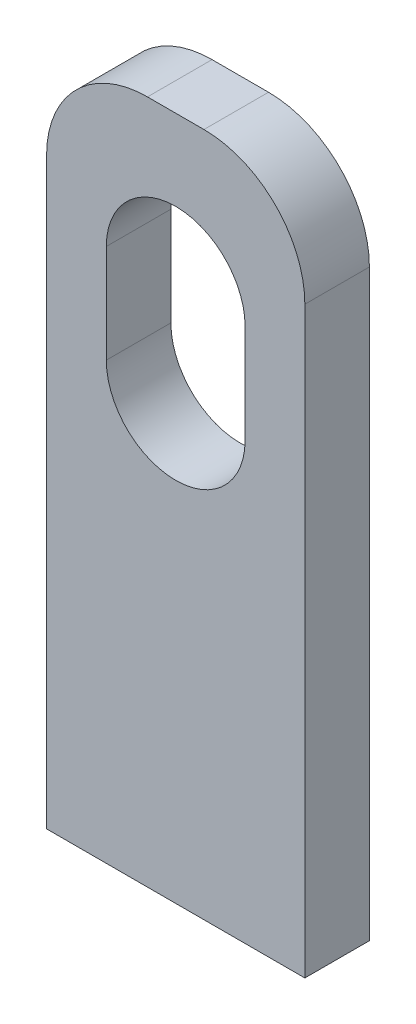
ISO-10303-21;
HEADER;
FILE_DESCRIPTION(('STEP AP214'),'2;1');
FILE_NAME('part.step','',(''),(''),'','','');
FILE_SCHEMA(('AUTOMOTIVE_DESIGN { 1 0 10303 214 1 1 1 1 }'));
ENDSEC;
DATA;
#1=APPLICATION_CONTEXT('core data for automotive mechanical design processes');
#2=APPLICATION_PROTOCOL_DEFINITION('international standard','automotive_design',2000,#1);
#3=PRODUCT_CONTEXT('',#1,'mechanical');
#4=PRODUCT('Part','Part','',(#3));
#5=PRODUCT_RELATED_PRODUCT_CATEGORY('part','',(#4));
#6=PRODUCT_DEFINITION_FORMATION('','',#4);
#7=PRODUCT_DEFINITION_CONTEXT('part definition',#1,'design');
#8=PRODUCT_DEFINITION('design','',#6,#7);
#9=PRODUCT_DEFINITION_SHAPE('','',#8);
#10=(LENGTH_UNIT() NAMED_UNIT(*) SI_UNIT(.MILLI.,.METRE.));
#11=(NAMED_UNIT(*) PLANE_ANGLE_UNIT() SI_UNIT($,.RADIAN.));
#12=(NAMED_UNIT(*) SI_UNIT($,.STERADIAN.) SOLID_ANGLE_UNIT());
#13=UNCERTAINTY_MEASURE_WITH_UNIT(LENGTH_MEASURE(1.E-05),#10,'distance_accuracy_value','');
#14=(GEOMETRIC_REPRESENTATION_CONTEXT(3) GLOBAL_UNCERTAINTY_ASSIGNED_CONTEXT((#13)) GLOBAL_UNIT_ASSIGNED_CONTEXT((#10,
#11,#12)) REPRESENTATION_CONTEXT('',''));
#15=CARTESIAN_POINT('',(0.,0.,0.));
#16=DIRECTION('',(0.,0.,1.));
#17=DIRECTION('',(1.,0.,0.));
#18=AXIS2_PLACEMENT_3D('',#15,#16,#17);
#19=CARTESIAN_POINT('',(0.,0.,-0.254));
#20=DIRECTION('',(0.,0.,-1.));
#21=DIRECTION('',(-1.,0.,0.));
#22=AXIS2_PLACEMENT_3D('',#19,#20,#21);
#23=PLANE('',#22);
#24=CARTESIAN_POINT('',(-0.222250000000001,1.89865,-0.254));
#25=DIRECTION('',(0.,0.,1.));
#26=DIRECTION('',(1.,0.,0.));
#27=AXIS2_PLACEMENT_3D('',#24,#25,#26);
#28=CIRCLE('',#27,0.79375);
#29=CARTESIAN_POINT('',(-0.22225,2.6924,-0.254));
#30=VERTEX_POINT('',#29);
#31=CARTESIAN_POINT('',(-1.016,1.89865,-0.254));
#32=VERTEX_POINT('',#31);
#33=EDGE_CURVE('E153',#30,#32,#28,.T.);
#34=ORIENTED_EDGE('',*,*,#33,.F.);
#35=DIRECTION('',(1.,0.,0.));
#36=VECTOR('',#35,1.);
#37=CARTESIAN_POINT('',(1.016,2.6924,-0.254));
#38=LINE('',#37,#36);
#39=CARTESIAN_POINT('',(0.222249999999999,2.6924,-0.254));
#40=VERTEX_POINT('',#39);
#41=EDGE_CURVE('E133',#40,#30,#38,.F.);
#42=ORIENTED_EDGE('',*,*,#41,.F.);
#43=CARTESIAN_POINT('',(0.22225,1.89865,-0.254));
#44=DIRECTION('',(0.,0.,1.));
#45=DIRECTION('',(1.,0.,0.));
#46=AXIS2_PLACEMENT_3D('',#43,#44,#45);
#47=CIRCLE('',#46,0.79375);
#48=CARTESIAN_POINT('',(1.016,1.89865,-0.254));
#49=VERTEX_POINT('',#48);
#50=EDGE_CURVE('E138',#49,#40,#47,.T.);
#51=ORIENTED_EDGE('',*,*,#50,.F.);
#52=DIRECTION('',(0.,1.,0.));
#53=VECTOR('',#52,1.);
#54=CARTESIAN_POINT('',(1.016,-2.6924,-0.254));
#55=LINE('',#54,#53);
#56=CARTESIAN_POINT('',(1.016,-2.6924,-0.254));
#57=VERTEX_POINT('',#56);
#58=EDGE_CURVE('E116',#57,#49,#55,.T.);
#59=ORIENTED_EDGE('',*,*,#58,.F.);
#60=DIRECTION('',(1.,0.,0.));
#61=VECTOR('',#60,1.);
#62=CARTESIAN_POINT('',(-1.016,-2.6924,-0.254));
#63=LINE('',#62,#61);
#64=CARTESIAN_POINT('',(-1.016,-2.6924,-0.254));
#65=VERTEX_POINT('',#64);
#66=EDGE_CURVE('E122',#65,#57,#63,.T.);
#67=ORIENTED_EDGE('',*,*,#66,.F.);
#68=DIRECTION('',(0.,-1.,0.));
#69=VECTOR('',#68,1.);
#70=CARTESIAN_POINT('',(-1.016,2.6924,-0.254));
#71=LINE('',#70,#69);
#72=EDGE_CURVE('E128',#32,#65,#71,.T.);
#73=ORIENTED_EDGE('',*,*,#72,.F.);
#74=EDGE_LOOP('',(#34,#42,#51,#59,#67,#73));
#75=FACE_BOUND('',#74,.T.);
#76=CARTESIAN_POINT('',(0.,0.7366,-0.254));
#77=DIRECTION('',(0.,0.,-1.));
#78=DIRECTION('',(-1.,0.,0.));
#79=AXIS2_PLACEMENT_3D('',#76,#77,#78);
#80=CIRCLE('',#79,0.5461);
#81=CARTESIAN_POINT('',(-0.5461,0.7366,-0.254));
#82=VERTEX_POINT('',#81);
#83=CARTESIAN_POINT('',(0.5461,0.736600000000001,-0.254));
#84=VERTEX_POINT('',#83);
#85=EDGE_CURVE('E103',#82,#84,#80,.F.);
#86=ORIENTED_EDGE('',*,*,#85,.T.);
#87=DIRECTION('',(0.,1.,0.));
#88=VECTOR('',#87,1.);
#89=CARTESIAN_POINT('',(0.5461,1.5113,-0.254));
#90=LINE('',#89,#88);
#91=CARTESIAN_POINT('',(0.5461,1.5113,-0.254));
#92=VERTEX_POINT('',#91);
#93=EDGE_CURVE('E102',#84,#92,#90,.T.);
#94=ORIENTED_EDGE('',*,*,#93,.T.);
#95=CARTESIAN_POINT('',(0.,1.5113,-0.254));
#96=DIRECTION('',(0.,0.,-1.));
#97=DIRECTION('',(-1.,0.,0.));
#98=AXIS2_PLACEMENT_3D('',#95,#96,#97);
#99=CIRCLE('',#98,0.5461);
#100=CARTESIAN_POINT('',(-0.5461,1.5113,-0.254));
#101=VERTEX_POINT('',#100);
#102=EDGE_CURVE('E20',#92,#101,#99,.F.);
#103=ORIENTED_EDGE('',*,*,#102,.T.);
#104=DIRECTION('',(0.,-1.,0.));
#105=VECTOR('',#104,1.);
#106=CARTESIAN_POINT('',(-0.5461,0.7366,-0.254));
#107=LINE('',#106,#105);
#108=EDGE_CURVE('E137',#101,#82,#107,.T.);
#109=ORIENTED_EDGE('',*,*,#108,.T.);
#110=EDGE_LOOP('',(#86,#94,#103,#109));
#111=FACE_BOUND('',#110,.T.);
#112=ADVANCED_FACE('F17',(#75,#111),#23,.T.);
#113=CARTESIAN_POINT('',(0.,1.5113,0.254));
#114=DIRECTION('',(0.,0.,-1.));
#115=DIRECTION('',(-1.,0.,0.));
#116=AXIS2_PLACEMENT_3D('',#113,#114,#115);
#117=CYLINDRICAL_SURFACE('',#116,0.5461);
#118=DIRECTION('',(0.,0.,1.));
#119=VECTOR('',#118,1.);
#120=CARTESIAN_POINT('',(0.5461,1.5113,0.254));
#121=LINE('',#120,#119);
#122=CARTESIAN_POINT('',(0.5461,1.5113,0.254));
#123=VERTEX_POINT('',#122);
#124=EDGE_CURVE('E94',#92,#123,#121,.T.);
#125=ORIENTED_EDGE('',*,*,#124,.T.);
#126=CARTESIAN_POINT('',(0.,1.5113,0.254));
#127=DIRECTION('',(0.,0.,-1.));
#128=DIRECTION('',(-1.,0.,0.));
#129=AXIS2_PLACEMENT_3D('',#126,#127,#128);
#130=CIRCLE('',#129,0.5461);
#131=CARTESIAN_POINT('',(-0.5461,1.5113,0.254));
#132=VERTEX_POINT('',#131);
#133=EDGE_CURVE('E119',#132,#123,#130,.T.);
#134=ORIENTED_EDGE('',*,*,#133,.F.);
#135=DIRECTION('',(0.,0.,1.));
#136=VECTOR('',#135,1.);
#137=CARTESIAN_POINT('',(-0.5461,1.5113,0.254));
#138=LINE('',#137,#136);
#139=EDGE_CURVE('E97',#132,#101,#138,.F.);
#140=ORIENTED_EDGE('',*,*,#139,.T.);
#141=ORIENTED_EDGE('',*,*,#102,.F.);
#142=EDGE_LOOP('',(#125,#134,#140,#141));
#143=FACE_BOUND('',#142,.T.);
#144=ADVANCED_FACE('F92',(#143),#117,.F.);
#145=CARTESIAN_POINT('',(0.5461,1.5113,0.254));
#146=DIRECTION('',(1.,0.,0.));
#147=DIRECTION('',(0.,1.,0.));
#148=AXIS2_PLACEMENT_3D('',#145,#146,#147);
#149=PLANE('',#148);
#150=DIRECTION('',(0.,0.,-1.));
#151=VECTOR('',#150,1.);
#152=CARTESIAN_POINT('',(0.5461,0.736600000000002,0.254));
#153=LINE('',#152,#151);
#154=CARTESIAN_POINT('',(0.5461,0.736600000000001,0.254));
#155=VERTEX_POINT('',#154);
#156=EDGE_CURVE('E106',#84,#155,#153,.F.);
#157=ORIENTED_EDGE('',*,*,#156,.T.);
#158=DIRECTION('',(0.,1.,0.));
#159=VECTOR('',#158,1.);
#160=CARTESIAN_POINT('',(0.5461,0.,0.254));
#161=LINE('',#160,#159);
#162=EDGE_CURVE('E110',#123,#155,#161,.F.);
#163=ORIENTED_EDGE('',*,*,#162,.F.);
#164=ORIENTED_EDGE('',*,*,#124,.F.);
#165=ORIENTED_EDGE('',*,*,#93,.F.);
#166=EDGE_LOOP('',(#157,#163,#164,#165));
#167=FACE_BOUND('',#166,.T.);
#168=ADVANCED_FACE('F108',(#167),#149,.F.);
#169=CARTESIAN_POINT('',(0.,0.7366,0.254));
#170=DIRECTION('',(0.,0.,-1.));
#171=DIRECTION('',(-1.,0.,0.));
#172=AXIS2_PLACEMENT_3D('',#169,#170,#171);
#173=CYLINDRICAL_SURFACE('',#172,0.5461);
#174=DIRECTION('',(0.,0.,1.));
#175=VECTOR('',#174,1.);
#176=CARTESIAN_POINT('',(-0.5461,0.7366,0.254));
#177=LINE('',#176,#175);
#178=CARTESIAN_POINT('',(-0.5461,0.7366,0.254));
#179=VERTEX_POINT('',#178);
#180=EDGE_CURVE('E155',#82,#179,#177,.T.);
#181=ORIENTED_EDGE('',*,*,#180,.T.);
#182=CARTESIAN_POINT('',(0.,0.7366,0.254));
#183=DIRECTION('',(0.,0.,-1.));
#184=DIRECTION('',(-1.,0.,0.));
#185=AXIS2_PLACEMENT_3D('',#182,#183,#184);
#186=CIRCLE('',#185,0.5461);
#187=EDGE_CURVE('E149',#155,#179,#186,.T.);
#188=ORIENTED_EDGE('',*,*,#187,.F.);
#189=ORIENTED_EDGE('',*,*,#156,.F.);
#190=ORIENTED_EDGE('',*,*,#85,.F.);
#191=EDGE_LOOP('',(#181,#188,#189,#190));
#192=FACE_BOUND('',#191,.T.);
#193=ADVANCED_FACE('F159',(#192),#173,.F.);
#194=CARTESIAN_POINT('',(-0.5461,0.7366,0.254));
#195=DIRECTION('',(-1.,0.,0.));
#196=DIRECTION('',(0.,-1.,0.));
#197=AXIS2_PLACEMENT_3D('',#194,#195,#196);
#198=PLANE('',#197);
#199=ORIENTED_EDGE('',*,*,#139,.F.);
#200=DIRECTION('',(0.,1.,0.));
#201=VECTOR('',#200,1.);
#202=CARTESIAN_POINT('',(-0.5461,0.,0.254));
#203=LINE('',#202,#201);
#204=EDGE_CURVE('E148',#179,#132,#203,.T.);
#205=ORIENTED_EDGE('',*,*,#204,.F.);
#206=ORIENTED_EDGE('',*,*,#180,.F.);
#207=ORIENTED_EDGE('',*,*,#108,.F.);
#208=EDGE_LOOP('',(#199,#205,#206,#207));
#209=FACE_BOUND('',#208,.T.);
#210=ADVANCED_FACE('F272',(#209),#198,.F.);
#211=CARTESIAN_POINT('',(0.22225,1.89865,0.));
#212=DIRECTION('',(0.,0.,1.));
#213=DIRECTION('',(1.,0.,0.));
#214=AXIS2_PLACEMENT_3D('',#211,#212,#213);
#215=CYLINDRICAL_SURFACE('',#214,0.79375);
#216=ORIENTED_EDGE('',*,*,#50,.T.);
#217=DIRECTION('',(0.,0.,1.));
#218=VECTOR('',#217,1.);
#219=CARTESIAN_POINT('',(0.222249999999999,2.6924,0.));
#220=LINE('',#219,#218);
#221=CARTESIAN_POINT('',(0.222249999999999,2.6924,0.254));
#222=VERTEX_POINT('',#221);
#223=EDGE_CURVE('E136',#222,#40,#220,.F.);
#224=ORIENTED_EDGE('',*,*,#223,.F.);
#225=CARTESIAN_POINT('',(0.22225,1.89865,0.254));
#226=DIRECTION('',(0.,0.,1.));
#227=DIRECTION('',(1.,0.,0.));
#228=AXIS2_PLACEMENT_3D('',#225,#226,#227);
#229=CIRCLE('',#228,0.79375);
#230=CARTESIAN_POINT('',(1.016,1.89865,0.254));
#231=VERTEX_POINT('',#230);
#232=EDGE_CURVE('E145',#231,#222,#229,.T.);
#233=ORIENTED_EDGE('',*,*,#232,.F.);
#234=DIRECTION('',(0.,0.,1.));
#235=VECTOR('',#234,1.);
#236=CARTESIAN_POINT('',(1.016,1.89865,0.));
#237=LINE('',#236,#235);
#238=EDGE_CURVE('E124',#49,#231,#237,.T.);
#239=ORIENTED_EDGE('',*,*,#238,.F.);
#240=EDGE_LOOP('',(#216,#224,#233,#239));
#241=FACE_BOUND('',#240,.T.);
#242=ADVANCED_FACE('F194',(#241),#215,.T.);
#243=CARTESIAN_POINT('',(1.016,2.6924,0.));
#244=DIRECTION('',(0.,1.,0.));
#245=DIRECTION('',(0.,0.,1.));
#246=AXIS2_PLACEMENT_3D('',#243,#244,#245);
#247=PLANE('',#246);
#248=DIRECTION('',(0.,0.,1.));
#249=VECTOR('',#248,1.);
#250=CARTESIAN_POINT('',(-0.22225,2.6924,0.));
#251=LINE('',#250,#249);
#252=CARTESIAN_POINT('',(-0.22225,2.6924,0.254));
#253=VERTEX_POINT('',#252);
#254=EDGE_CURVE('E135',#253,#30,#251,.F.);
#255=ORIENTED_EDGE('',*,*,#254,.F.);
#256=DIRECTION('',(1.,0.,0.));
#257=VECTOR('',#256,1.);
#258=CARTESIAN_POINT('',(0.,2.6924,0.254));
#259=LINE('',#258,#257);
#260=EDGE_CURVE('E144',#222,#253,#259,.F.);
#261=ORIENTED_EDGE('',*,*,#260,.F.);
#262=ORIENTED_EDGE('',*,*,#223,.T.);
#263=ORIENTED_EDGE('',*,*,#41,.T.);
#264=EDGE_LOOP('',(#255,#261,#262,#263));
#265=FACE_BOUND('',#264,.T.);
#266=ADVANCED_FACE('F189',(#265),#247,.T.);
#267=CARTESIAN_POINT('',(-0.222250000000001,1.89865,0.));
#268=DIRECTION('',(0.,0.,1.));
#269=DIRECTION('',(1.,0.,0.));
#270=AXIS2_PLACEMENT_3D('',#267,#268,#269);
#271=CYLINDRICAL_SURFACE('',#270,0.79375);
#272=ORIENTED_EDGE('',*,*,#33,.T.);
#273=DIRECTION('',(0.,0.,1.));
#274=VECTOR('',#273,1.);
#275=CARTESIAN_POINT('',(-1.016,1.89865,0.));
#276=LINE('',#275,#274);
#277=CARTESIAN_POINT('',(-1.016,1.89865,0.254));
#278=VERTEX_POINT('',#277);
#279=EDGE_CURVE('E130',#278,#32,#276,.F.);
#280=ORIENTED_EDGE('',*,*,#279,.F.);
#281=CARTESIAN_POINT('',(-0.222250000000001,1.89865,0.254));
#282=DIRECTION('',(0.,0.,1.));
#283=DIRECTION('',(1.,0.,0.));
#284=AXIS2_PLACEMENT_3D('',#281,#282,#283);
#285=CIRCLE('',#284,0.79375);
#286=EDGE_CURVE('E140',#253,#278,#285,.T.);
#287=ORIENTED_EDGE('',*,*,#286,.F.);
#288=ORIENTED_EDGE('',*,*,#254,.T.);
#289=EDGE_LOOP('',(#272,#280,#287,#288));
#290=FACE_BOUND('',#289,.T.);
#291=ADVANCED_FACE('F202',(#290),#271,.T.);
#292=CARTESIAN_POINT('',(-1.016,2.6924,0.));
#293=DIRECTION('',(-1.,0.,0.));
#294=DIRECTION('',(0.,-1.,0.));
#295=AXIS2_PLACEMENT_3D('',#292,#293,#294);
#296=PLANE('',#295);
#297=DIRECTION('',(0.,0.,-1.));
#298=VECTOR('',#297,1.);
#299=CARTESIAN_POINT('',(-1.016,-2.6924,0.));
#300=LINE('',#299,#298);
#301=CARTESIAN_POINT('',(-1.016,-2.6924,0.254));
#302=VERTEX_POINT('',#301);
#303=EDGE_CURVE('E125',#302,#65,#300,.T.);
#304=ORIENTED_EDGE('',*,*,#303,.F.);
#305=DIRECTION('',(0.,1.,0.));
#306=VECTOR('',#305,1.);
#307=CARTESIAN_POINT('',(-1.016,0.,0.254));
#308=LINE('',#307,#306);
#309=EDGE_CURVE('E143',#278,#302,#308,.F.);
#310=ORIENTED_EDGE('',*,*,#309,.F.);
#311=ORIENTED_EDGE('',*,*,#279,.T.);
#312=ORIENTED_EDGE('',*,*,#72,.T.);
#313=EDGE_LOOP('',(#304,#310,#311,#312));
#314=FACE_BOUND('',#313,.T.);
#315=ADVANCED_FACE('F212',(#314),#296,.T.);
#316=CARTESIAN_POINT('',(-1.016,-2.6924,0.));
#317=DIRECTION('',(0.,-1.,0.));
#318=DIRECTION('',(0.,0.,-1.));
#319=AXIS2_PLACEMENT_3D('',#316,#317,#318);
#320=PLANE('',#319);
#321=ORIENTED_EDGE('',*,*,#303,.T.);
#322=ORIENTED_EDGE('',*,*,#66,.T.);
#323=DIRECTION('',(0.,0.,1.));
#324=VECTOR('',#323,1.);
#325=CARTESIAN_POINT('',(1.016,-2.6924,0.));
#326=LINE('',#325,#324);
#327=CARTESIAN_POINT('',(1.016,-2.6924,0.254));
#328=VERTEX_POINT('',#327);
#329=EDGE_CURVE('E35',#328,#57,#326,.F.);
#330=ORIENTED_EDGE('',*,*,#329,.F.);
#331=DIRECTION('',(1.,0.,0.));
#332=VECTOR('',#331,1.);
#333=CARTESIAN_POINT('',(0.,-2.6924,0.254));
#334=LINE('',#333,#332);
#335=EDGE_CURVE('E26',#302,#328,#334,.T.);
#336=ORIENTED_EDGE('',*,*,#335,.F.);
#337=EDGE_LOOP('',(#321,#322,#330,#336));
#338=FACE_BOUND('',#337,.T.);
#339=ADVANCED_FACE('F213',(#338),#320,.T.);
#340=CARTESIAN_POINT('',(1.016,-2.6924,0.));
#341=DIRECTION('',(1.,0.,0.));
#342=DIRECTION('',(0.,1.,0.));
#343=AXIS2_PLACEMENT_3D('',#340,#341,#342);
#344=PLANE('',#343);
#345=ORIENTED_EDGE('',*,*,#329,.T.);
#346=ORIENTED_EDGE('',*,*,#58,.T.);
#347=ORIENTED_EDGE('',*,*,#238,.T.);
#348=DIRECTION('',(0.,1.,0.));
#349=VECTOR('',#348,1.);
#350=CARTESIAN_POINT('',(1.016,0.,0.254));
#351=LINE('',#350,#349);
#352=EDGE_CURVE('E11',#328,#231,#351,.T.);
#353=ORIENTED_EDGE('',*,*,#352,.F.);
#354=EDGE_LOOP('',(#345,#346,#347,#353));
#355=FACE_BOUND('',#354,.T.);
#356=ADVANCED_FACE('F215',(#355),#344,.T.);
#357=CARTESIAN_POINT('',(0.,0.,0.254));
#358=DIRECTION('',(0.,0.,1.));
#359=DIRECTION('',(1.,0.,0.));
#360=AXIS2_PLACEMENT_3D('',#357,#358,#359);
#361=PLANE('',#360);
#362=ORIENTED_EDGE('',*,*,#335,.T.);
#363=ORIENTED_EDGE('',*,*,#352,.T.);
#364=ORIENTED_EDGE('',*,*,#232,.T.);
#365=ORIENTED_EDGE('',*,*,#260,.T.);
#366=ORIENTED_EDGE('',*,*,#286,.T.);
#367=ORIENTED_EDGE('',*,*,#309,.T.);
#368=EDGE_LOOP('',(#362,#363,#364,#365,#366,#367));
#369=FACE_BOUND('',#368,.T.);
#370=ORIENTED_EDGE('',*,*,#187,.T.);
#371=ORIENTED_EDGE('',*,*,#204,.T.);
#372=ORIENTED_EDGE('',*,*,#133,.T.);
#373=ORIENTED_EDGE('',*,*,#162,.T.);
#374=EDGE_LOOP('',(#370,#371,#372,#373));
#375=FACE_BOUND('',#374,.T.);
#376=ADVANCED_FACE('F164',(#369,#375),#361,.T.);
#377=CLOSED_SHELL('',(#112,#144,#168,#193,#210,#242,#266,#291,#315,#339,#356,#376));
#378=MANIFOLD_SOLID_BREP('B1',#377);
#379=ADVANCED_BREP_SHAPE_REPRESENTATION('',(#18,#378),#14);
#380=SHAPE_DEFINITION_REPRESENTATION(#9,#379);
ENDSEC;
END-ISO-10303-21;
